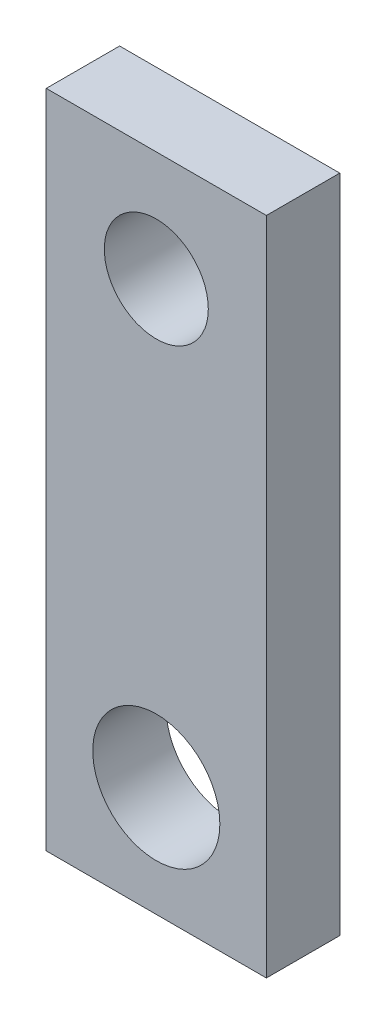
ISO-10303-21;
HEADER;
FILE_DESCRIPTION(('STEP AP214'),'2;1');
FILE_NAME('part.step','',(''),(''),'','','');
FILE_SCHEMA(('AUTOMOTIVE_DESIGN { 1 0 10303 214 1 1 1 1 }'));
ENDSEC;
DATA;
#1=APPLICATION_CONTEXT('core data for automotive mechanical design processes');
#2=APPLICATION_PROTOCOL_DEFINITION('international standard','automotive_design',2000,#1);
#3=PRODUCT_CONTEXT('',#1,'mechanical');
#4=PRODUCT('Part','Part','',(#3));
#5=PRODUCT_RELATED_PRODUCT_CATEGORY('part','',(#4));
#6=PRODUCT_DEFINITION_FORMATION('','',#4);
#7=PRODUCT_DEFINITION_CONTEXT('part definition',#1,'design');
#8=PRODUCT_DEFINITION('design','',#6,#7);
#9=PRODUCT_DEFINITION_SHAPE('','',#8);
#10=(LENGTH_UNIT() NAMED_UNIT(*) SI_UNIT(.MILLI.,.METRE.));
#11=(NAMED_UNIT(*) PLANE_ANGLE_UNIT() SI_UNIT($,.RADIAN.));
#12=(NAMED_UNIT(*) SI_UNIT($,.STERADIAN.) SOLID_ANGLE_UNIT());
#13=UNCERTAINTY_MEASURE_WITH_UNIT(LENGTH_MEASURE(1.E-05),#10,'distance_accuracy_value','');
#14=(GEOMETRIC_REPRESENTATION_CONTEXT(3) GLOBAL_UNCERTAINTY_ASSIGNED_CONTEXT((#13)) GLOBAL_UNIT_ASSIGNED_CONTEXT((#10,
#11,#12)) REPRESENTATION_CONTEXT('',''));
#15=CARTESIAN_POINT('',(0.,0.,0.));
#16=DIRECTION('',(0.,0.,1.));
#17=DIRECTION('',(1.,0.,0.));
#18=AXIS2_PLACEMENT_3D('',#15,#16,#17);
#19=CARTESIAN_POINT('',(9.52500000000006,89.9309999999999,6.35));
#20=DIRECTION('',(-1.,0.,0.));
#21=DIRECTION('',(0.,-1.,0.));
#22=AXIS2_PLACEMENT_3D('',#19,#20,#21);
#23=PLANE('',#22);
#24=DIRECTION('',(0.,1.,0.));
#25=VECTOR('',#24,1.);
#26=CARTESIAN_POINT('',(9.52500000000006,89.9309999999999,0.));
#27=LINE('',#26,#25);
#28=CARTESIAN_POINT('',(9.52500000000005,32.7809999999999,0.));
#29=VERTEX_POINT('',#28);
#30=CARTESIAN_POINT('',(9.52500000000006,89.9309999999999,0.));
#31=VERTEX_POINT('',#30);
#32=EDGE_CURVE('E106',#29,#31,#27,.T.);
#33=ORIENTED_EDGE('',*,*,#32,.T.);
#34=DIRECTION('',(0.,0.,-1.));
#35=VECTOR('',#34,1.);
#36=CARTESIAN_POINT('',(9.52500000000006,89.9309999999999,6.35));
#37=LINE('',#36,#35);
#38=CARTESIAN_POINT('',(9.52500000000006,89.9309999999999,6.35));
#39=VERTEX_POINT('',#38);
#40=EDGE_CURVE('E11',#39,#31,#37,.T.);
#41=ORIENTED_EDGE('',*,*,#40,.F.);
#42=DIRECTION('',(0.,1.,0.));
#43=VECTOR('',#42,1.);
#44=CARTESIAN_POINT('',(9.52500000000006,89.9309999999999,6.35));
#45=LINE('',#44,#43);
#46=CARTESIAN_POINT('',(9.52500000000005,32.7809999999999,6.35));
#47=VERTEX_POINT('',#46);
#48=EDGE_CURVE('E90',#47,#39,#45,.T.);
#49=ORIENTED_EDGE('',*,*,#48,.F.);
#50=DIRECTION('',(0.,0.,-1.));
#51=VECTOR('',#50,1.);
#52=CARTESIAN_POINT('',(9.52500000000005,32.7809999999999,6.35));
#53=LINE('',#52,#51);
#54=EDGE_CURVE('E102',#47,#29,#53,.T.);
#55=ORIENTED_EDGE('',*,*,#54,.T.);
#56=EDGE_LOOP('',(#33,#41,#49,#55));
#57=FACE_BOUND('',#56,.T.);
#58=ADVANCED_FACE('F38',(#57),#23,.F.);
#59=CARTESIAN_POINT('',(9.52500000000006,89.9309999999999,6.35));
#60=DIRECTION('',(0.,-1.,0.));
#61=DIRECTION('',(0.,0.,-1.));
#62=AXIS2_PLACEMENT_3D('',#59,#60,#61);
#63=PLANE('',#62);
#64=DIRECTION('',(-1.,0.,0.));
#65=VECTOR('',#64,1.);
#66=CARTESIAN_POINT('',(9.52500000000006,89.9309999999999,0.));
#67=LINE('',#66,#65);
#68=CARTESIAN_POINT('',(-9.52499999999995,89.9309999999999,0.));
#69=VERTEX_POINT('',#68);
#70=EDGE_CURVE('E95',#31,#69,#67,.T.);
#71=ORIENTED_EDGE('',*,*,#70,.T.);
#72=DIRECTION('',(0.,0.,-1.));
#73=VECTOR('',#72,1.);
#74=CARTESIAN_POINT('',(-9.52499999999995,89.9309999999999,6.35));
#75=LINE('',#74,#73);
#76=CARTESIAN_POINT('',(-9.52499999999995,89.9309999999999,6.35));
#77=VERTEX_POINT('',#76);
#78=EDGE_CURVE('E47',#77,#69,#75,.T.);
#79=ORIENTED_EDGE('',*,*,#78,.F.);
#80=DIRECTION('',(-1.,0.,0.));
#81=VECTOR('',#80,1.);
#82=CARTESIAN_POINT('',(9.52500000000006,89.9309999999999,6.35));
#83=LINE('',#82,#81);
#84=EDGE_CURVE('E85',#39,#77,#83,.T.);
#85=ORIENTED_EDGE('',*,*,#84,.F.);
#86=ORIENTED_EDGE('',*,*,#40,.T.);
#87=EDGE_LOOP('',(#71,#79,#85,#86));
#88=FACE_BOUND('',#87,.T.);
#89=ADVANCED_FACE('F94',(#88),#63,.F.);
#90=CARTESIAN_POINT('',(-9.52499999999995,89.9309999999999,6.35));
#91=DIRECTION('',(1.,0.,0.));
#92=DIRECTION('',(0.,1.,0.));
#93=AXIS2_PLACEMENT_3D('',#90,#91,#92);
#94=PLANE('',#93);
#95=DIRECTION('',(0.,-1.,0.));
#96=VECTOR('',#95,1.);
#97=CARTESIAN_POINT('',(-9.52499999999995,89.9309999999999,0.));
#98=LINE('',#97,#96);
#99=CARTESIAN_POINT('',(-9.52499999999994,32.7809999999999,0.));
#100=VERTEX_POINT('',#99);
#101=EDGE_CURVE('E72',#69,#100,#98,.T.);
#102=ORIENTED_EDGE('',*,*,#101,.T.);
#103=DIRECTION('',(0.,0.,-1.));
#104=VECTOR('',#103,1.);
#105=CARTESIAN_POINT('',(-9.52499999999994,32.7809999999999,6.35));
#106=LINE('',#105,#104);
#107=CARTESIAN_POINT('',(-9.52499999999994,32.7809999999999,6.35));
#108=VERTEX_POINT('',#107);
#109=EDGE_CURVE('E97',#108,#100,#106,.T.);
#110=ORIENTED_EDGE('',*,*,#109,.F.);
#111=DIRECTION('',(0.,-1.,0.));
#112=VECTOR('',#111,1.);
#113=CARTESIAN_POINT('',(-9.52499999999995,89.9309999999999,6.35));
#114=LINE('',#113,#112);
#115=EDGE_CURVE('E88',#77,#108,#114,.T.);
#116=ORIENTED_EDGE('',*,*,#115,.F.);
#117=ORIENTED_EDGE('',*,*,#78,.T.);
#118=EDGE_LOOP('',(#102,#110,#116,#117));
#119=FACE_BOUND('',#118,.T.);
#120=ADVANCED_FACE('F98',(#119),#94,.F.);
#121=CARTESIAN_POINT('',(9.52500000000005,32.7809999999999,6.35));
#122=DIRECTION('',(0.,1.,0.));
#123=DIRECTION('',(0.,0.,1.));
#124=AXIS2_PLACEMENT_3D('',#121,#122,#123);
#125=PLANE('',#124);
#126=DIRECTION('',(1.,0.,0.));
#127=VECTOR('',#126,1.);
#128=CARTESIAN_POINT('',(9.52500000000005,32.7809999999999,0.));
#129=LINE('',#128,#127);
#130=EDGE_CURVE('E78',#100,#29,#129,.T.);
#131=ORIENTED_EDGE('',*,*,#130,.T.);
#132=ORIENTED_EDGE('',*,*,#54,.F.);
#133=DIRECTION('',(1.,0.,0.));
#134=VECTOR('',#133,1.);
#135=CARTESIAN_POINT('',(9.52500000000005,32.7809999999999,6.35));
#136=LINE('',#135,#134);
#137=EDGE_CURVE('E55',#108,#47,#136,.T.);
#138=ORIENTED_EDGE('',*,*,#137,.F.);
#139=ORIENTED_EDGE('',*,*,#109,.T.);
#140=EDGE_LOOP('',(#131,#132,#138,#139));
#141=FACE_BOUND('',#140,.T.);
#142=ADVANCED_FACE('F120',(#141),#125,.F.);
#143=CARTESIAN_POINT('',(0.,0.,6.35));
#144=DIRECTION('',(0.,0.,-1.));
#145=DIRECTION('',(-1.,0.,0.));
#146=AXIS2_PLACEMENT_3D('',#143,#144,#145);
#147=PLANE('',#146);
#148=CARTESIAN_POINT('',(0.,80.4059999999999,6.35));
#149=DIRECTION('',(0.,0.,1.));
#150=DIRECTION('',(1.,0.,0.));
#151=AXIS2_PLACEMENT_3D('',#148,#149,#150);
#152=CIRCLE('',#151,4.5);
#153=CARTESIAN_POINT('',(4.50000000000009,80.4059999999999,6.35));
#154=VERTEX_POINT('',#153);
#155=EDGE_CURVE('E138',#154,#154,#152,.T.);
#156=ORIENTED_EDGE('',*,*,#155,.F.);
#157=EDGE_LOOP('',(#156));
#158=FACE_BOUND('',#157,.T.);
#159=CARTESIAN_POINT('',(0.,42.3059999999999,6.35));
#160=DIRECTION('',(0.,0.,1.));
#161=DIRECTION('',(1.,0.,0.));
#162=AXIS2_PLACEMENT_3D('',#159,#160,#161);
#163=CIRCLE('',#162,5.5);
#164=CARTESIAN_POINT('',(5.50000000000009,42.3059999999999,6.35));
#165=VERTEX_POINT('',#164);
#166=EDGE_CURVE('E130',#165,#165,#163,.T.);
#167=ORIENTED_EDGE('',*,*,#166,.F.);
#168=EDGE_LOOP('',(#167));
#169=FACE_BOUND('',#168,.T.);
#170=ORIENTED_EDGE('',*,*,#48,.T.);
#171=ORIENTED_EDGE('',*,*,#84,.T.);
#172=ORIENTED_EDGE('',*,*,#115,.T.);
#173=ORIENTED_EDGE('',*,*,#137,.T.);
#174=EDGE_LOOP('',(#170,#171,#172,#173));
#175=FACE_BOUND('',#174,.T.);
#176=ADVANCED_FACE('F86',(#158,#169,#175),#147,.F.);
#177=CARTESIAN_POINT('',(0.,0.,0.));
#178=DIRECTION('',(0.,0.,-1.));
#179=DIRECTION('',(-1.,0.,0.));
#180=AXIS2_PLACEMENT_3D('',#177,#178,#179);
#181=PLANE('',#180);
#182=CARTESIAN_POINT('',(0.,80.4059999999999,0.));
#183=DIRECTION('',(0.,0.,-1.));
#184=DIRECTION('',(-1.,0.,0.));
#185=AXIS2_PLACEMENT_3D('',#182,#183,#184);
#186=CIRCLE('',#185,4.5);
#187=CARTESIAN_POINT('',(-4.4999999999999,80.4059999999999,0.));
#188=VERTEX_POINT('',#187);
#189=EDGE_CURVE('E134',#188,#188,#186,.T.);
#190=ORIENTED_EDGE('',*,*,#189,.F.);
#191=EDGE_LOOP('',(#190));
#192=FACE_BOUND('',#191,.T.);
#193=CARTESIAN_POINT('',(0.,42.3059999999999,0.));
#194=DIRECTION('',(0.,0.,-1.));
#195=DIRECTION('',(-1.,0.,0.));
#196=AXIS2_PLACEMENT_3D('',#193,#194,#195);
#197=CIRCLE('',#196,5.49999999999999);
#198=CARTESIAN_POINT('',(-5.4999999999999,42.3059999999999,0.));
#199=VERTEX_POINT('',#198);
#200=EDGE_CURVE('E110',#199,#199,#197,.T.);
#201=ORIENTED_EDGE('',*,*,#200,.F.);
#202=EDGE_LOOP('',(#201));
#203=FACE_BOUND('',#202,.T.);
#204=ORIENTED_EDGE('',*,*,#32,.F.);
#205=ORIENTED_EDGE('',*,*,#130,.F.);
#206=ORIENTED_EDGE('',*,*,#101,.F.);
#207=ORIENTED_EDGE('',*,*,#70,.F.);
#208=EDGE_LOOP('',(#204,#205,#206,#207));
#209=FACE_BOUND('',#208,.T.);
#210=ADVANCED_FACE('F123',(#192,#203,#209),#181,.T.);
#211=CARTESIAN_POINT('',(0.,42.3059999999999,6.35));
#212=DIRECTION('',(0.,0.,1.));
#213=DIRECTION('',(1.,0.,0.));
#214=AXIS2_PLACEMENT_3D('',#211,#212,#213);
#215=CYLINDRICAL_SURFACE('',#214,5.49999999999999);
#216=ORIENTED_EDGE('',*,*,#200,.T.);
#217=EDGE_LOOP('',(#216));
#218=FACE_BOUND('',#217,.T.);
#219=ORIENTED_EDGE('',*,*,#166,.T.);
#220=EDGE_LOOP('',(#219));
#221=FACE_BOUND('',#220,.T.);
#222=ADVANCED_FACE('F150',(#218,#221),#215,.F.);
#223=CARTESIAN_POINT('',(0.,80.4059999999999,6.35));
#224=DIRECTION('',(0.,0.,1.));
#225=DIRECTION('',(1.,0.,0.));
#226=AXIS2_PLACEMENT_3D('',#223,#224,#225);
#227=CYLINDRICAL_SURFACE('',#226,4.5);
#228=ORIENTED_EDGE('',*,*,#189,.T.);
#229=EDGE_LOOP('',(#228));
#230=FACE_BOUND('',#229,.T.);
#231=ORIENTED_EDGE('',*,*,#155,.T.);
#232=EDGE_LOOP('',(#231));
#233=FACE_BOUND('',#232,.T.);
#234=ADVANCED_FACE('F143',(#230,#233),#227,.F.);
#235=CLOSED_SHELL('',(#58,#89,#120,#142,#176,#210,#222,#234));
#236=MANIFOLD_SOLID_BREP('B2',#235);
#237=ADVANCED_BREP_SHAPE_REPRESENTATION('',(#18,#236),#14);
#238=SHAPE_DEFINITION_REPRESENTATION(#9,#237);
ENDSEC;
END-ISO-10303-21;
